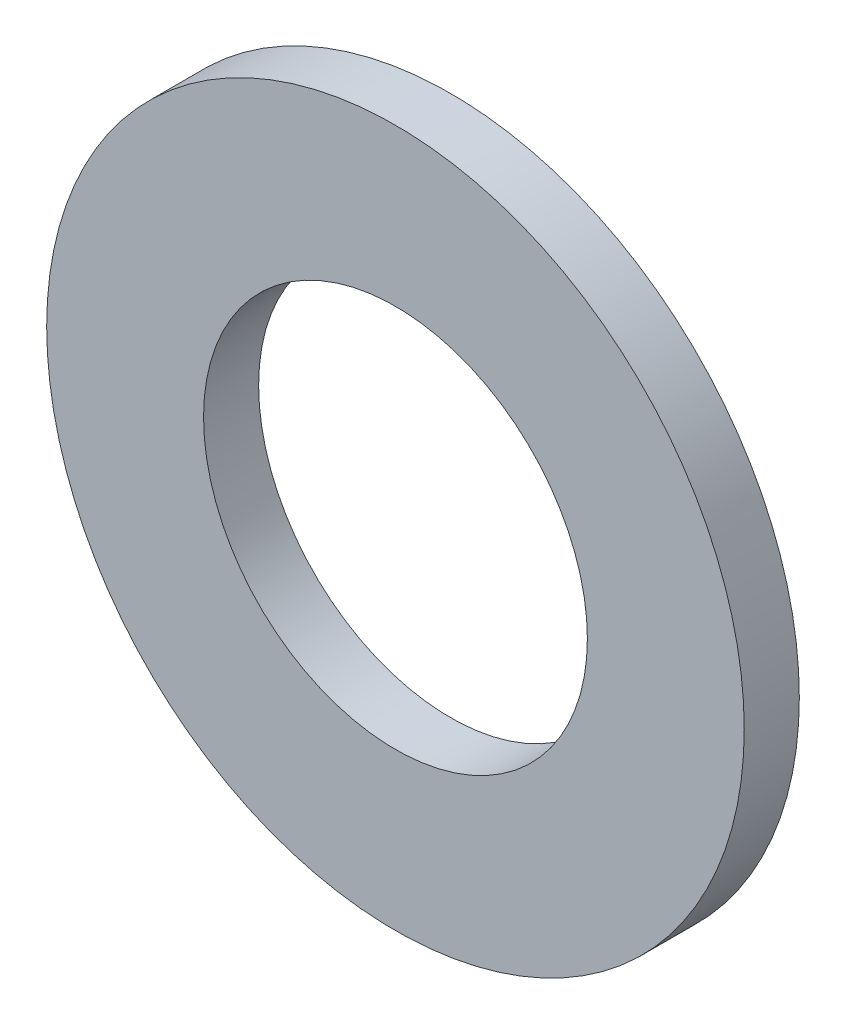
ISO-10303-21;
HEADER;
FILE_DESCRIPTION(('STEP AP214'),'2;1');
FILE_NAME('part.step','',(''),(''),'','','');
FILE_SCHEMA(('AUTOMOTIVE_DESIGN { 1 0 10303 214 1 1 1 1 }'));
ENDSEC;
DATA;
#1=APPLICATION_CONTEXT('core data for automotive mechanical design processes');
#2=APPLICATION_PROTOCOL_DEFINITION('international standard','automotive_design',2000,#1);
#3=PRODUCT_CONTEXT('',#1,'mechanical');
#4=PRODUCT('Part','Part','',(#3));
#5=PRODUCT_RELATED_PRODUCT_CATEGORY('part','',(#4));
#6=PRODUCT_DEFINITION_FORMATION('','',#4);
#7=PRODUCT_DEFINITION_CONTEXT('part definition',#1,'design');
#8=PRODUCT_DEFINITION('design','',#6,#7);
#9=PRODUCT_DEFINITION_SHAPE('','',#8);
#10=(LENGTH_UNIT() NAMED_UNIT(*) SI_UNIT(.MILLI.,.METRE.));
#11=(NAMED_UNIT(*) PLANE_ANGLE_UNIT() SI_UNIT($,.RADIAN.));
#12=(NAMED_UNIT(*) SI_UNIT($,.STERADIAN.) SOLID_ANGLE_UNIT());
#13=UNCERTAINTY_MEASURE_WITH_UNIT(LENGTH_MEASURE(1.E-05),#10,'distance_accuracy_value','');
#14=(GEOMETRIC_REPRESENTATION_CONTEXT(3) GLOBAL_UNCERTAINTY_ASSIGNED_CONTEXT((#13)) GLOBAL_UNIT_ASSIGNED_CONTEXT((#10,
#11,#12)) REPRESENTATION_CONTEXT('',''));
#15=CARTESIAN_POINT('',(0.,0.,0.));
#16=DIRECTION('',(0.,0.,1.));
#17=DIRECTION('',(1.,0.,0.));
#18=AXIS2_PLACEMENT_3D('',#15,#16,#17);
#19=CARTESIAN_POINT('',(0.,0.,0.20955));
#20=DIRECTION('',(0.,0.,1.));
#21=DIRECTION('',(1.,0.,0.));
#22=AXIS2_PLACEMENT_3D('',#19,#20,#21);
#23=PLANE('',#22);
#24=CARTESIAN_POINT('',(0.,0.,0.20955));
#25=DIRECTION('',(0.,0.,1.));
#26=DIRECTION('',(1.,0.,0.));
#27=AXIS2_PLACEMENT_3D('',#24,#25,#26);
#28=CIRCLE('',#27,2.6543);
#29=CARTESIAN_POINT('',(2.6543,0.,0.20955));
#30=VERTEX_POINT('',#29);
#31=EDGE_CURVE('E10',#30,#30,#28,.T.);
#32=ORIENTED_EDGE('',*,*,#31,.T.);
#33=EDGE_LOOP('',(#32));
#34=FACE_BOUND('',#33,.T.);
#35=CARTESIAN_POINT('',(0.,0.,0.20955));
#36=DIRECTION('',(0.,0.,1.));
#37=DIRECTION('',(1.,0.,0.));
#38=AXIS2_PLACEMENT_3D('',#35,#36,#37);
#39=CIRCLE('',#38,1.4605);
#40=CARTESIAN_POINT('',(1.4605,0.,0.20955));
#41=VERTEX_POINT('',#40);
#42=EDGE_CURVE('E43',#41,#41,#39,.T.);
#43=ORIENTED_EDGE('',*,*,#42,.F.);
#44=EDGE_LOOP('',(#43));
#45=FACE_BOUND('',#44,.T.);
#46=ADVANCED_FACE('F32',(#34,#45),#23,.T.);
#47=CARTESIAN_POINT('',(0.,0.,-0.20955));
#48=DIRECTION('',(0.,0.,1.));
#49=DIRECTION('',(1.,0.,0.));
#50=AXIS2_PLACEMENT_3D('',#47,#48,#49);
#51=PLANE('',#50);
#52=CARTESIAN_POINT('',(0.,0.,-0.20955));
#53=DIRECTION('',(0.,0.,1.));
#54=DIRECTION('',(1.,0.,0.));
#55=AXIS2_PLACEMENT_3D('',#52,#53,#54);
#56=CIRCLE('',#55,2.6543);
#57=CARTESIAN_POINT('',(2.6543,0.,-0.20955));
#58=VERTEX_POINT('',#57);
#59=EDGE_CURVE('E36',#58,#58,#56,.T.);
#60=ORIENTED_EDGE('',*,*,#59,.F.);
#61=EDGE_LOOP('',(#60));
#62=FACE_BOUND('',#61,.T.);
#63=CARTESIAN_POINT('',(0.,0.,-0.20955));
#64=DIRECTION('',(0.,0.,1.));
#65=DIRECTION('',(1.,0.,0.));
#66=AXIS2_PLACEMENT_3D('',#63,#64,#65);
#67=CIRCLE('',#66,1.4605);
#68=CARTESIAN_POINT('',(1.4605,0.,-0.20955));
#69=VERTEX_POINT('',#68);
#70=EDGE_CURVE('E45',#69,#69,#67,.T.);
#71=ORIENTED_EDGE('',*,*,#70,.T.);
#72=EDGE_LOOP('',(#71));
#73=FACE_BOUND('',#72,.T.);
#74=ADVANCED_FACE('F55',(#62,#73),#51,.F.);
#75=CARTESIAN_POINT('',(0.,0.,0.20955));
#76=DIRECTION('',(0.,0.,-1.));
#77=DIRECTION('',(-1.,0.,0.));
#78=AXIS2_PLACEMENT_3D('',#75,#76,#77);
#79=CYLINDRICAL_SURFACE('',#78,2.6543);
#80=ORIENTED_EDGE('',*,*,#31,.F.);
#81=EDGE_LOOP('',(#80));
#82=FACE_BOUND('',#81,.T.);
#83=ORIENTED_EDGE('',*,*,#59,.T.);
#84=EDGE_LOOP('',(#83));
#85=FACE_BOUND('',#84,.T.);
#86=ADVANCED_FACE('F34',(#82,#85),#79,.T.);
#87=CARTESIAN_POINT('',(0.,0.,0.20955));
#88=DIRECTION('',(0.,0.,-1.));
#89=DIRECTION('',(-1.,0.,0.));
#90=AXIS2_PLACEMENT_3D('',#87,#88,#89);
#91=CYLINDRICAL_SURFACE('',#90,1.4605);
#92=ORIENTED_EDGE('',*,*,#42,.T.);
#93=EDGE_LOOP('',(#92));
#94=FACE_BOUND('',#93,.T.);
#95=ORIENTED_EDGE('',*,*,#70,.F.);
#96=EDGE_LOOP('',(#95));
#97=FACE_BOUND('',#96,.T.);
#98=ADVANCED_FACE('F51',(#94,#97),#91,.F.);
#99=CLOSED_SHELL('',(#46,#74,#86,#98));
#100=MANIFOLD_SOLID_BREP('B2',#99);
#101=ADVANCED_BREP_SHAPE_REPRESENTATION('',(#18,#100),#14);
#102=SHAPE_DEFINITION_REPRESENTATION(#9,#101);
ENDSEC;
END-ISO-10303-21;
